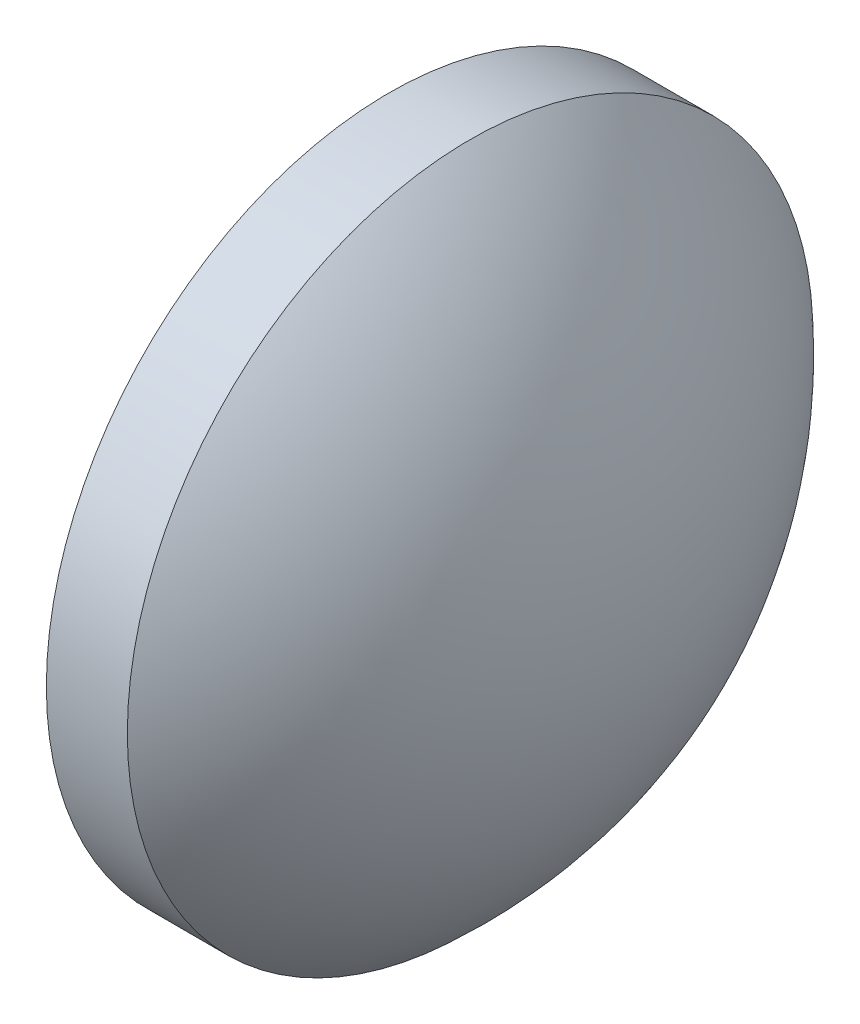
ISO-10303-21;
HEADER;
FILE_DESCRIPTION(('STEP AP214'),'2;1');
FILE_NAME('part.step','',(''),(''),'','','');
FILE_SCHEMA(('AUTOMOTIVE_DESIGN { 1 0 10303 214 1 1 1 1 }'));
ENDSEC;
DATA;
#1=APPLICATION_CONTEXT('core data for automotive mechanical design processes');
#2=APPLICATION_PROTOCOL_DEFINITION('international standard','automotive_design',2000,#1);
#3=PRODUCT_CONTEXT('',#1,'mechanical');
#4=PRODUCT('Part','Part','',(#3));
#5=PRODUCT_RELATED_PRODUCT_CATEGORY('part','',(#4));
#6=PRODUCT_DEFINITION_FORMATION('','',#4);
#7=PRODUCT_DEFINITION_CONTEXT('part definition',#1,'design');
#8=PRODUCT_DEFINITION('design','',#6,#7);
#9=PRODUCT_DEFINITION_SHAPE('','',#8);
#10=(LENGTH_UNIT() NAMED_UNIT(*) SI_UNIT(.MILLI.,.METRE.));
#11=(NAMED_UNIT(*) PLANE_ANGLE_UNIT() SI_UNIT($,.RADIAN.));
#12=(NAMED_UNIT(*) SI_UNIT($,.STERADIAN.) SOLID_ANGLE_UNIT());
#13=UNCERTAINTY_MEASURE_WITH_UNIT(LENGTH_MEASURE(1.E-05),#10,'distance_accuracy_value','');
#14=(GEOMETRIC_REPRESENTATION_CONTEXT(3) GLOBAL_UNCERTAINTY_ASSIGNED_CONTEXT((#13)) GLOBAL_UNIT_ASSIGNED_CONTEXT((#10,
#11,#12)) REPRESENTATION_CONTEXT('',''));
#15=CARTESIAN_POINT('',(0.,0.,0.));
#16=DIRECTION('',(0.,0.,1.));
#17=DIRECTION('',(1.,0.,0.));
#18=AXIS2_PLACEMENT_3D('',#15,#16,#17);
#19=CARTESIAN_POINT('',(404.970088802336,28.2908287836638,0.));
#20=DIRECTION('',(-1.,0.,0.));
#21=DIRECTION('',(0.,-1.,0.));
#22=AXIS2_PLACEMENT_3D('',#19,#20,#21);
#23=SPHERICAL_SURFACE('',#22,8.60044642857143);
#24=CARTESIAN_POINT('',(410.770535230908,28.2908287836638,0.));
#25=DIRECTION('',(-1.,0.,0.));
#26=DIRECTION('',(0.,0.,1.));
#27=AXIS2_PLACEMENT_3D('',#24,#25,#26);
#28=CIRCLE('',#27,6.35);
#29=CARTESIAN_POINT('',(410.770535230908,28.2908287836638,6.35));
#30=VERTEX_POINT('',#29);
#31=EDGE_CURVE('E10',#30,#30,#28,.T.);
#32=ORIENTED_EDGE('',*,*,#31,.F.);
#33=EDGE_LOOP('',(#32));
#34=FACE_BOUND('',#33,.T.);
#35=ADVANCED_FACE('F35',(#34),#23,.T.);
#36=CARTESIAN_POINT('',(407.010004085053,28.2908287836638,0.));
#37=DIRECTION('',(-1.,0.,0.));
#38=DIRECTION('',(0.,0.,1.));
#39=AXIS2_PLACEMENT_3D('',#36,#37,#38);
#40=CYLINDRICAL_SURFACE('',#39,6.35);
#41=CARTESIAN_POINT('',(409.270535230908,28.2908287836638,0.));
#42=DIRECTION('',(-1.,0.,0.));
#43=DIRECTION('',(0.,0.,1.));
#44=AXIS2_PLACEMENT_3D('',#41,#42,#43);
#45=CIRCLE('',#44,6.35);
#46=CARTESIAN_POINT('',(409.270535230908,28.2908287836638,6.35));
#47=VERTEX_POINT('',#46);
#48=EDGE_CURVE('E41',#47,#47,#45,.T.);
#49=ORIENTED_EDGE('',*,*,#48,.F.);
#50=EDGE_LOOP('',(#49));
#51=FACE_BOUND('',#50,.T.);
#52=ORIENTED_EDGE('',*,*,#31,.T.);
#53=EDGE_LOOP('',(#52));
#54=FACE_BOUND('',#53,.T.);
#55=ADVANCED_FACE('F49',(#51,#54),#40,.T.);
#56=CARTESIAN_POINT('',(409.270535230908,28.2908287836638,0.));
#57=DIRECTION('',(1.,0.,0.));
#58=DIRECTION('',(0.,0.,-1.));
#59=AXIS2_PLACEMENT_3D('',#56,#57,#58);
#60=PLANE('',#59);
#61=ORIENTED_EDGE('',*,*,#48,.T.);
#62=EDGE_LOOP('',(#61));
#63=FACE_BOUND('',#62,.T.);
#64=ADVANCED_FACE('F47',(#63),#60,.F.);
#65=CLOSED_SHELL('',(#35,#55,#64));
#66=MANIFOLD_SOLID_BREP('B2',#65);
#67=ADVANCED_BREP_SHAPE_REPRESENTATION('',(#18,#66),#14);
#68=SHAPE_DEFINITION_REPRESENTATION(#9,#67);
ENDSEC;
END-ISO-10303-21;
